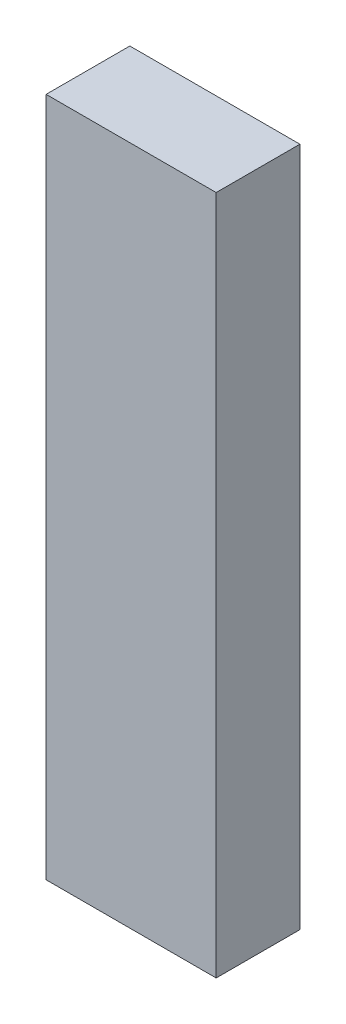
ISO-10303-21;
HEADER;
FILE_DESCRIPTION(('STEP AP214'),'2;1');
FILE_NAME('part.step','',(''),(''),'','','');
FILE_SCHEMA(('AUTOMOTIVE_DESIGN { 1 0 10303 214 1 1 1 1 }'));
ENDSEC;
DATA;
#1=APPLICATION_CONTEXT('core data for automotive mechanical design processes');
#2=APPLICATION_PROTOCOL_DEFINITION('international standard','automotive_design',2000,#1);
#3=PRODUCT_CONTEXT('',#1,'mechanical');
#4=PRODUCT('Part','Part','',(#3));
#5=PRODUCT_RELATED_PRODUCT_CATEGORY('part','',(#4));
#6=PRODUCT_DEFINITION_FORMATION('','',#4);
#7=PRODUCT_DEFINITION_CONTEXT('part definition',#1,'design');
#8=PRODUCT_DEFINITION('design','',#6,#7);
#9=PRODUCT_DEFINITION_SHAPE('','',#8);
#10=(LENGTH_UNIT() NAMED_UNIT(*) SI_UNIT(.MILLI.,.METRE.));
#11=(NAMED_UNIT(*) PLANE_ANGLE_UNIT() SI_UNIT($,.RADIAN.));
#12=(NAMED_UNIT(*) SI_UNIT($,.STERADIAN.) SOLID_ANGLE_UNIT());
#13=UNCERTAINTY_MEASURE_WITH_UNIT(LENGTH_MEASURE(1.E-05),#10,'distance_accuracy_value','');
#14=(GEOMETRIC_REPRESENTATION_CONTEXT(3) GLOBAL_UNCERTAINTY_ASSIGNED_CONTEXT((#13)) GLOBAL_UNIT_ASSIGNED_CONTEXT((#10,
#11,#12)) REPRESENTATION_CONTEXT('',''));
#15=CARTESIAN_POINT('',(0.,0.,0.));
#16=DIRECTION('',(0.,0.,1.));
#17=DIRECTION('',(1.,0.,0.));
#18=AXIS2_PLACEMENT_3D('',#15,#16,#17);
#19=CARTESIAN_POINT('',(-0.3250057,-3.71420136,0.31999936));
#20=DIRECTION('',(0.,0.,-1.));
#21=DIRECTION('',(-1.,0.,0.));
#22=AXIS2_PLACEMENT_3D('',#19,#20,#21);
#23=PLANE('',#22);
#24=DIRECTION('',(0.,1.,0.));
#25=VECTOR('',#24,1.);
#26=CARTESIAN_POINT('',(0.32499554,-6.31420124,0.31999936));
#27=LINE('',#26,#25);
#28=CARTESIAN_POINT('',(0.32499554,-6.31420124,0.31999936));
#29=VERTEX_POINT('',#28);
#30=CARTESIAN_POINT('',(0.32499554,-3.71420136,0.31999936));
#31=VERTEX_POINT('',#30);
#32=EDGE_CURVE('E80',#29,#31,#27,.T.);
#33=ORIENTED_EDGE('',*,*,#32,.T.);
#34=DIRECTION('',(1.,0.,0.));
#35=VECTOR('',#34,1.);
#36=CARTESIAN_POINT('',(0.32499554,-3.71420136,0.31999936));
#37=LINE('',#36,#35);
#38=CARTESIAN_POINT('',(-0.3250057,-3.71420136,0.31999936));
#39=VERTEX_POINT('',#38);
#40=EDGE_CURVE('E55',#31,#39,#37,.F.);
#41=ORIENTED_EDGE('',*,*,#40,.T.);
#42=DIRECTION('',(0.,1.,0.));
#43=VECTOR('',#42,1.);
#44=CARTESIAN_POINT('',(-0.3250057,-3.71420136,0.31999936));
#45=LINE('',#44,#43);
#46=CARTESIAN_POINT('',(-0.3250057,-6.31420124,0.31999936));
#47=VERTEX_POINT('',#46);
#48=EDGE_CURVE('E57',#39,#47,#45,.F.);
#49=ORIENTED_EDGE('',*,*,#48,.T.);
#50=DIRECTION('',(1.,0.,0.));
#51=VECTOR('',#50,1.);
#52=CARTESIAN_POINT('',(-0.3250057,-6.31420124,0.31999936));
#53=LINE('',#52,#51);
#54=EDGE_CURVE('E20',#47,#29,#53,.T.);
#55=ORIENTED_EDGE('',*,*,#54,.T.);
#56=EDGE_LOOP('',(#33,#41,#49,#55));
#57=FACE_BOUND('',#56,.T.);
#58=ADVANCED_FACE('F17',(#57),#23,.F.);
#59=CARTESIAN_POINT('',(-0.3250057,-6.31420124,0.));
#60=DIRECTION('',(0.,1.,0.));
#61=DIRECTION('',(0.,0.,1.));
#62=AXIS2_PLACEMENT_3D('',#59,#60,#61);
#63=PLANE('',#62);
#64=ORIENTED_EDGE('',*,*,#54,.F.);
#65=DIRECTION('',(0.,0.,-1.));
#66=VECTOR('',#65,1.);
#67=CARTESIAN_POINT('',(-0.3250057,-6.31420124,0.));
#68=LINE('',#67,#66);
#69=CARTESIAN_POINT('',(-0.3250057,-6.31420124,0.));
#70=VERTEX_POINT('',#69);
#71=EDGE_CURVE('E63',#47,#70,#68,.T.);
#72=ORIENTED_EDGE('',*,*,#71,.T.);
#73=DIRECTION('',(-1.,0.,0.));
#74=VECTOR('',#73,1.);
#75=CARTESIAN_POINT('',(-0.3250057,-6.31420124,0.));
#76=LINE('',#75,#74);
#77=CARTESIAN_POINT('',(0.32499554,-6.31420124,0.));
#78=VERTEX_POINT('',#77);
#79=EDGE_CURVE('E83',#78,#70,#76,.T.);
#80=ORIENTED_EDGE('',*,*,#79,.F.);
#81=DIRECTION('',(0.,0.,1.));
#82=VECTOR('',#81,1.);
#83=CARTESIAN_POINT('',(0.32499554,-6.31420124,0.));
#84=LINE('',#83,#82);
#85=EDGE_CURVE('E68',#78,#29,#84,.T.);
#86=ORIENTED_EDGE('',*,*,#85,.T.);
#87=EDGE_LOOP('',(#64,#72,#80,#86));
#88=FACE_BOUND('',#87,.T.);
#89=ADVANCED_FACE('F65',(#88),#63,.F.);
#90=CARTESIAN_POINT('',(-0.3250057,-3.71420136,0.));
#91=DIRECTION('',(1.,0.,0.));
#92=DIRECTION('',(0.,0.,-1.));
#93=AXIS2_PLACEMENT_3D('',#90,#91,#92);
#94=PLANE('',#93);
#95=ORIENTED_EDGE('',*,*,#48,.F.);
#96=DIRECTION('',(0.,0.,-1.));
#97=VECTOR('',#96,1.);
#98=CARTESIAN_POINT('',(-0.3250057,-3.71420136,0.));
#99=LINE('',#98,#97);
#100=CARTESIAN_POINT('',(-0.3250057,-3.71420136,0.));
#101=VERTEX_POINT('',#100);
#102=EDGE_CURVE('E75',#39,#101,#99,.T.);
#103=ORIENTED_EDGE('',*,*,#102,.T.);
#104=DIRECTION('',(0.,1.,0.));
#105=VECTOR('',#104,1.);
#106=CARTESIAN_POINT('',(-0.3250057,-3.71420136,0.));
#107=LINE('',#106,#105);
#108=EDGE_CURVE('E72',#70,#101,#107,.T.);
#109=ORIENTED_EDGE('',*,*,#108,.F.);
#110=ORIENTED_EDGE('',*,*,#71,.F.);
#111=EDGE_LOOP('',(#95,#103,#109,#110));
#112=FACE_BOUND('',#111,.T.);
#113=ADVANCED_FACE('F70',(#112),#94,.F.);
#114=CARTESIAN_POINT('',(0.32499554,-3.71420136,0.));
#115=DIRECTION('',(0.,-1.,0.));
#116=DIRECTION('',(0.,0.,-1.));
#117=AXIS2_PLACEMENT_3D('',#114,#115,#116);
#118=PLANE('',#117);
#119=ORIENTED_EDGE('',*,*,#40,.F.);
#120=DIRECTION('',(0.,0.,1.));
#121=VECTOR('',#120,1.);
#122=CARTESIAN_POINT('',(0.32499554,-3.71420136,0.));
#123=LINE('',#122,#121);
#124=CARTESIAN_POINT('',(0.32499554,-3.71420136,0.));
#125=VERTEX_POINT('',#124);
#126=EDGE_CURVE('E35',#31,#125,#123,.F.);
#127=ORIENTED_EDGE('',*,*,#126,.T.);
#128=DIRECTION('',(-1.,0.,0.));
#129=VECTOR('',#128,1.);
#130=CARTESIAN_POINT('',(-0.3250057,-3.71420136,0.));
#131=LINE('',#130,#129);
#132=EDGE_CURVE('E26',#101,#125,#131,.F.);
#133=ORIENTED_EDGE('',*,*,#132,.F.);
#134=ORIENTED_EDGE('',*,*,#102,.F.);
#135=EDGE_LOOP('',(#119,#127,#133,#134));
#136=FACE_BOUND('',#135,.T.);
#137=ADVANCED_FACE('F89',(#136),#118,.F.);
#138=CARTESIAN_POINT('',(0.32499554,-6.31420124,0.));
#139=DIRECTION('',(-1.,0.,0.));
#140=DIRECTION('',(0.,0.,1.));
#141=AXIS2_PLACEMENT_3D('',#138,#139,#140);
#142=PLANE('',#141);
#143=ORIENTED_EDGE('',*,*,#32,.F.);
#144=ORIENTED_EDGE('',*,*,#85,.F.);
#145=DIRECTION('',(0.,1.,0.));
#146=VECTOR('',#145,1.);
#147=CARTESIAN_POINT('',(0.32499554,-3.71420136,0.));
#148=LINE('',#147,#146);
#149=EDGE_CURVE('E11',#125,#78,#148,.F.);
#150=ORIENTED_EDGE('',*,*,#149,.F.);
#151=ORIENTED_EDGE('',*,*,#126,.F.);
#152=EDGE_LOOP('',(#143,#144,#150,#151));
#153=FACE_BOUND('',#152,.T.);
#154=ADVANCED_FACE('F91',(#153),#142,.F.);
#155=CARTESIAN_POINT('',(-0.3250057,-3.71420136,0.));
#156=DIRECTION('',(0.,0.,-1.));
#157=DIRECTION('',(-1.,0.,0.));
#158=AXIS2_PLACEMENT_3D('',#155,#156,#157);
#159=PLANE('',#158);
#160=ORIENTED_EDGE('',*,*,#132,.T.);
#161=ORIENTED_EDGE('',*,*,#149,.T.);
#162=ORIENTED_EDGE('',*,*,#79,.T.);
#163=ORIENTED_EDGE('',*,*,#108,.T.);
#164=EDGE_LOOP('',(#160,#161,#162,#163));
#165=FACE_BOUND('',#164,.T.);
#166=ADVANCED_FACE('F88',(#165),#159,.T.);
#167=CLOSED_SHELL('',(#58,#89,#113,#137,#154,#166));
#168=MANIFOLD_SOLID_BREP('B1',#167);
#169=ADVANCED_BREP_SHAPE_REPRESENTATION('',(#18,#168),#14);
#170=SHAPE_DEFINITION_REPRESENTATION(#9,#169);
ENDSEC;
END-ISO-10303-21;
